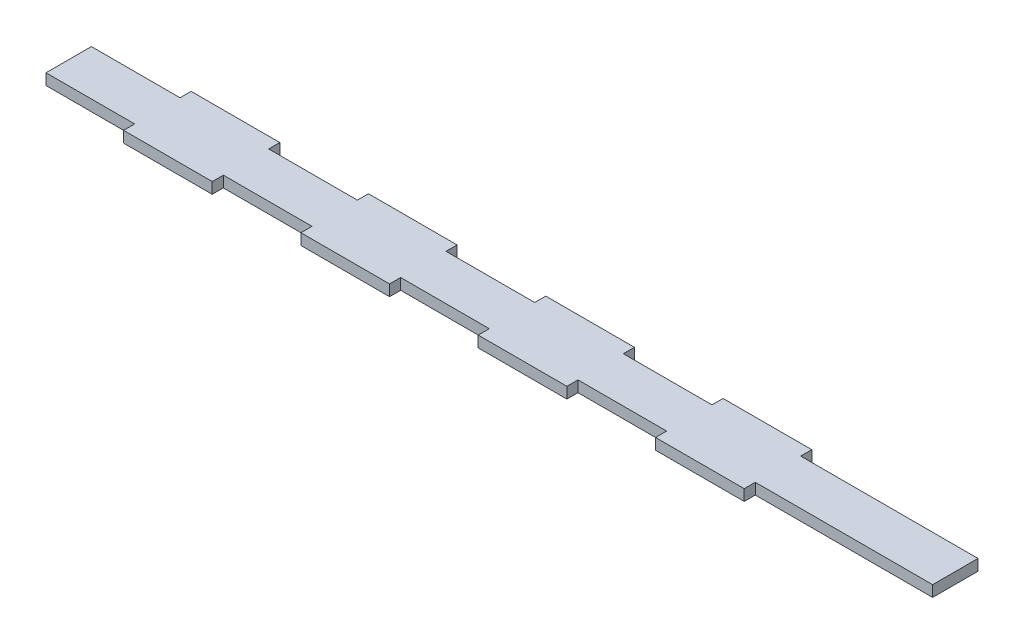
ISO-10303-21;
HEADER;
FILE_DESCRIPTION(('STEP AP214'),'2;1');
FILE_NAME('part.step','',(''),(''),'','','');
FILE_SCHEMA(('AUTOMOTIVE_DESIGN { 1 0 10303 214 1 1 1 1 }'));
ENDSEC;
DATA;
#1=APPLICATION_CONTEXT('core data for automotive mechanical design processes');
#2=APPLICATION_PROTOCOL_DEFINITION('international standard','automotive_design',2000,#1);
#3=PRODUCT_CONTEXT('',#1,'mechanical');
#4=PRODUCT('Part','Part','',(#3));
#5=PRODUCT_RELATED_PRODUCT_CATEGORY('part','',(#4));
#6=PRODUCT_DEFINITION_FORMATION('','',#4);
#7=PRODUCT_DEFINITION_CONTEXT('part definition',#1,'design');
#8=PRODUCT_DEFINITION('design','',#6,#7);
#9=PRODUCT_DEFINITION_SHAPE('','',#8);
#10=(LENGTH_UNIT() NAMED_UNIT(*) SI_UNIT(.MILLI.,.METRE.));
#11=(NAMED_UNIT(*) PLANE_ANGLE_UNIT() SI_UNIT($,.RADIAN.));
#12=(NAMED_UNIT(*) SI_UNIT($,.STERADIAN.) SOLID_ANGLE_UNIT());
#13=UNCERTAINTY_MEASURE_WITH_UNIT(LENGTH_MEASURE(1.E-05),#10,'distance_accuracy_value','');
#14=(GEOMETRIC_REPRESENTATION_CONTEXT(3) GLOBAL_UNCERTAINTY_ASSIGNED_CONTEXT((#13)) GLOBAL_UNIT_ASSIGNED_CONTEXT((#10,
#11,#12)) REPRESENTATION_CONTEXT('',''));
#15=CARTESIAN_POINT('',(0.,0.,0.));
#16=DIRECTION('',(0.,0.,1.));
#17=DIRECTION('',(1.,0.,0.));
#18=AXIS2_PLACEMENT_3D('',#15,#16,#17);
#19=CARTESIAN_POINT('',(0.,1.5875,6.5));
#20=DIRECTION('',(0.,0.,-1.));
#21=DIRECTION('',(-1.,0.,0.));
#22=AXIS2_PLACEMENT_3D('',#19,#20,#21);
#23=PLANE('',#22);
#24=DIRECTION('',(0.,-1.,0.));
#25=VECTOR('',#24,1.);
#26=CARTESIAN_POINT('',(-88.9,1.5875,6.5));
#27=LINE('',#26,#25);
#28=CARTESIAN_POINT('',(-88.9,1.5875,6.5));
#29=VERTEX_POINT('',#28);
#30=CARTESIAN_POINT('',(-88.9,-1.5875,6.5));
#31=VERTEX_POINT('',#30);
#32=EDGE_CURVE('E12',#29,#31,#27,.T.);
#33=ORIENTED_EDGE('',*,*,#32,.F.);
#34=DIRECTION('',(1.,0.,0.));
#35=VECTOR('',#34,1.);
#36=CARTESIAN_POINT('',(0.,1.5875,6.5));
#37=LINE('',#36,#35);
#38=CARTESIAN_POINT('',(-114.3,1.5875,6.5));
#39=VERTEX_POINT('',#38);
#40=EDGE_CURVE('E814',#39,#29,#37,.T.);
#41=ORIENTED_EDGE('',*,*,#40,.F.);
#42=DIRECTION('',(0.,-1.,0.));
#43=VECTOR('',#42,1.);
#44=CARTESIAN_POINT('',(-114.3,1.5875,6.5));
#45=LINE('',#44,#43);
#46=CARTESIAN_POINT('',(-114.3,-1.5875,6.5));
#47=VERTEX_POINT('',#46);
#48=EDGE_CURVE('E443',#39,#47,#45,.T.);
#49=ORIENTED_EDGE('',*,*,#48,.T.);
#50=DIRECTION('',(1.,0.,0.));
#51=VECTOR('',#50,1.);
#52=CARTESIAN_POINT('',(0.,-1.5875,6.5));
#53=LINE('',#52,#51);
#54=EDGE_CURVE('E579',#47,#31,#53,.T.);
#55=ORIENTED_EDGE('',*,*,#54,.T.);
#56=EDGE_LOOP('',(#33,#41,#49,#55));
#57=FACE_BOUND('',#56,.T.);
#58=ADVANCED_FACE('F329',(#57),#23,.F.);
#59=CARTESIAN_POINT('',(-63.5,1.5875,6.5));
#60=VERTEX_POINT('',#59);
#61=CARTESIAN_POINT('',(-38.1,1.5875,6.5));
#62=VERTEX_POINT('',#61);
#63=EDGE_CURVE('E825',#60,#62,#37,.T.);
#64=ORIENTED_EDGE('',*,*,#63,.F.);
#65=DIRECTION('',(0.,-1.,0.));
#66=VECTOR('',#65,1.);
#67=CARTESIAN_POINT('',(-63.5,1.5875,6.5));
#68=LINE('',#67,#66);
#69=CARTESIAN_POINT('',(-63.5,-1.5875,6.5));
#70=VERTEX_POINT('',#69);
#71=EDGE_CURVE('E339',#60,#70,#68,.T.);
#72=ORIENTED_EDGE('',*,*,#71,.T.);
#73=CARTESIAN_POINT('',(-38.1,-1.5875,6.5));
#74=VERTEX_POINT('',#73);
#75=EDGE_CURVE('E578',#70,#74,#53,.T.);
#76=ORIENTED_EDGE('',*,*,#75,.T.);
#77=DIRECTION('',(0.,-1.,0.));
#78=VECTOR('',#77,1.);
#79=CARTESIAN_POINT('',(-38.1,1.5875,6.5));
#80=LINE('',#79,#78);
#81=EDGE_CURVE('E446',#62,#74,#80,.T.);
#82=ORIENTED_EDGE('',*,*,#81,.F.);
#83=EDGE_LOOP('',(#64,#72,#76,#82));
#84=FACE_BOUND('',#83,.T.);
#85=ADVANCED_FACE('F900',(#84),#23,.F.);
#86=CARTESIAN_POINT('',(-38.1,1.5875,0.));
#87=DIRECTION('',(1.,0.,0.));
#88=DIRECTION('',(0.,0.,-1.));
#89=AXIS2_PLACEMENT_3D('',#86,#87,#88);
#90=PLANE('',#89);
#91=DIRECTION('',(0.,0.,1.));
#92=VECTOR('',#91,1.);
#93=CARTESIAN_POINT('',(-38.1,-1.5875,0.));
#94=LINE('',#93,#92);
#95=CARTESIAN_POINT('',(-38.1,-1.5875,9.675));
#96=VERTEX_POINT('',#95);
#97=EDGE_CURVE('E582',#74,#96,#94,.T.);
#98=ORIENTED_EDGE('',*,*,#97,.T.);
#99=DIRECTION('',(0.,-1.,0.));
#100=VECTOR('',#99,1.);
#101=CARTESIAN_POINT('',(-38.1,1.5875,9.675));
#102=LINE('',#101,#100);
#103=CARTESIAN_POINT('',(-38.1,1.5875,9.675));
#104=VERTEX_POINT('',#103);
#105=EDGE_CURVE('E674',#104,#96,#102,.T.);
#106=ORIENTED_EDGE('',*,*,#105,.F.);
#107=DIRECTION('',(0.,0.,1.));
#108=VECTOR('',#107,1.);
#109=CARTESIAN_POINT('',(-38.1,1.5875,0.));
#110=LINE('',#109,#108);
#111=EDGE_CURVE('E687',#62,#104,#110,.T.);
#112=ORIENTED_EDGE('',*,*,#111,.F.);
#113=ORIENTED_EDGE('',*,*,#81,.T.);
#114=EDGE_LOOP('',(#98,#106,#112,#113));
#115=FACE_BOUND('',#114,.T.);
#116=ADVANCED_FACE('F682',(#115),#90,.F.);
#117=CARTESIAN_POINT('',(0.,1.5875,9.675));
#118=DIRECTION('',(0.,0.,-1.));
#119=DIRECTION('',(-1.,0.,0.));
#120=AXIS2_PLACEMENT_3D('',#117,#118,#119);
#121=PLANE('',#120);
#122=DIRECTION('',(1.,0.,0.));
#123=VECTOR('',#122,1.);
#124=CARTESIAN_POINT('',(0.,-1.5875,9.675));
#125=LINE('',#124,#123);
#126=CARTESIAN_POINT('',(-12.7,-1.5875,9.675));
#127=VERTEX_POINT('',#126);
#128=EDGE_CURVE('E586',#96,#127,#125,.T.);
#129=ORIENTED_EDGE('',*,*,#128,.T.);
#130=DIRECTION('',(0.,-1.,0.));
#131=VECTOR('',#130,1.);
#132=CARTESIAN_POINT('',(-12.7,1.5875,9.675));
#133=LINE('',#132,#131);
#134=CARTESIAN_POINT('',(-12.7,1.5875,9.675));
#135=VERTEX_POINT('',#134);
#136=EDGE_CURVE('E671',#135,#127,#133,.T.);
#137=ORIENTED_EDGE('',*,*,#136,.F.);
#138=DIRECTION('',(1.,0.,0.));
#139=VECTOR('',#138,1.);
#140=CARTESIAN_POINT('',(0.,1.5875,9.675));
#141=LINE('',#140,#139);
#142=EDGE_CURVE('E832',#104,#135,#141,.T.);
#143=ORIENTED_EDGE('',*,*,#142,.F.);
#144=ORIENTED_EDGE('',*,*,#105,.T.);
#145=EDGE_LOOP('',(#129,#137,#143,#144));
#146=FACE_BOUND('',#145,.T.);
#147=ADVANCED_FACE('F701',(#146),#121,.F.);
#148=CARTESIAN_POINT('',(-12.7,1.5875,0.));
#149=DIRECTION('',(1.,0.,0.));
#150=DIRECTION('',(0.,0.,-1.));
#151=AXIS2_PLACEMENT_3D('',#148,#149,#150);
#152=PLANE('',#151);
#153=DIRECTION('',(0.,0.,1.));
#154=VECTOR('',#153,1.);
#155=CARTESIAN_POINT('',(-12.7,-1.5875,0.));
#156=LINE('',#155,#154);
#157=CARTESIAN_POINT('',(-12.7,-1.5875,6.5));
#158=VERTEX_POINT('',#157);
#159=EDGE_CURVE('E589',#158,#127,#156,.T.);
#160=ORIENTED_EDGE('',*,*,#159,.F.);
#161=DIRECTION('',(0.,-1.,0.));
#162=VECTOR('',#161,1.);
#163=CARTESIAN_POINT('',(-12.7,1.5875,6.5));
#164=LINE('',#163,#162);
#165=CARTESIAN_POINT('',(-12.7,1.5875,6.5));
#166=VERTEX_POINT('',#165);
#167=EDGE_CURVE('E668',#166,#158,#164,.T.);
#168=ORIENTED_EDGE('',*,*,#167,.F.);
#169=DIRECTION('',(0.,0.,1.));
#170=VECTOR('',#169,1.);
#171=CARTESIAN_POINT('',(-12.7,1.5875,0.));
#172=LINE('',#171,#170);
#173=EDGE_CURVE('E835',#166,#135,#172,.T.);
#174=ORIENTED_EDGE('',*,*,#173,.T.);
#175=ORIENTED_EDGE('',*,*,#136,.T.);
#176=EDGE_LOOP('',(#160,#168,#174,#175));
#177=FACE_BOUND('',#176,.T.);
#178=ADVANCED_FACE('F919',(#177),#152,.T.);
#179=CARTESIAN_POINT('',(12.7,-1.5875,6.5));
#180=VERTEX_POINT('',#179);
#181=EDGE_CURVE('E583',#158,#180,#53,.T.);
#182=ORIENTED_EDGE('',*,*,#181,.T.);
#183=DIRECTION('',(0.,-1.,0.));
#184=VECTOR('',#183,1.);
#185=CARTESIAN_POINT('',(12.7,1.5875,6.5));
#186=LINE('',#185,#184);
#187=CARTESIAN_POINT('',(12.7,1.5875,6.5));
#188=VERTEX_POINT('',#187);
#189=EDGE_CURVE('E665',#188,#180,#186,.T.);
#190=ORIENTED_EDGE('',*,*,#189,.F.);
#191=EDGE_CURVE('E830',#166,#188,#37,.T.);
#192=ORIENTED_EDGE('',*,*,#191,.F.);
#193=ORIENTED_EDGE('',*,*,#167,.T.);
#194=EDGE_LOOP('',(#182,#190,#192,#193));
#195=FACE_BOUND('',#194,.T.);
#196=ADVANCED_FACE('F872',(#195),#23,.F.);
#197=CARTESIAN_POINT('',(12.7,1.5875,0.));
#198=DIRECTION('',(1.,0.,0.));
#199=DIRECTION('',(0.,0.,-1.));
#200=AXIS2_PLACEMENT_3D('',#197,#198,#199);
#201=PLANE('',#200);
#202=DIRECTION('',(0.,0.,1.));
#203=VECTOR('',#202,1.);
#204=CARTESIAN_POINT('',(12.7,-1.5875,0.));
#205=LINE('',#204,#203);
#206=CARTESIAN_POINT('',(12.7,-1.5875,9.675));
#207=VERTEX_POINT('',#206);
#208=EDGE_CURVE('E592',#180,#207,#205,.T.);
#209=ORIENTED_EDGE('',*,*,#208,.T.);
#210=DIRECTION('',(0.,-1.,0.));
#211=VECTOR('',#210,1.);
#212=CARTESIAN_POINT('',(12.7,1.5875,9.675));
#213=LINE('',#212,#211);
#214=CARTESIAN_POINT('',(12.7,1.5875,9.675));
#215=VERTEX_POINT('',#214);
#216=EDGE_CURVE('E662',#215,#207,#213,.T.);
#217=ORIENTED_EDGE('',*,*,#216,.F.);
#218=DIRECTION('',(0.,0.,1.));
#219=VECTOR('',#218,1.);
#220=CARTESIAN_POINT('',(12.7,1.5875,0.));
#221=LINE('',#220,#219);
#222=EDGE_CURVE('E837',#188,#215,#221,.T.);
#223=ORIENTED_EDGE('',*,*,#222,.F.);
#224=ORIENTED_EDGE('',*,*,#189,.T.);
#225=EDGE_LOOP('',(#209,#217,#223,#224));
#226=FACE_BOUND('',#225,.T.);
#227=ADVANCED_FACE('F875',(#226),#201,.F.);
#228=CARTESIAN_POINT('',(0.,1.5875,9.675));
#229=DIRECTION('',(0.,0.,-1.));
#230=DIRECTION('',(-1.,0.,0.));
#231=AXIS2_PLACEMENT_3D('',#228,#229,#230);
#232=PLANE('',#231);
#233=DIRECTION('',(1.,0.,0.));
#234=VECTOR('',#233,1.);
#235=CARTESIAN_POINT('',(0.,-1.5875,9.675));
#236=LINE('',#235,#234);
#237=CARTESIAN_POINT('',(38.1000000000001,-1.5875,9.675));
#238=VERTEX_POINT('',#237);
#239=EDGE_CURVE('E595',#207,#238,#236,.T.);
#240=ORIENTED_EDGE('',*,*,#239,.T.);
#241=DIRECTION('',(0.,-1.,0.));
#242=VECTOR('',#241,1.);
#243=CARTESIAN_POINT('',(38.1000000000001,1.5875,9.675));
#244=LINE('',#243,#242);
#245=CARTESIAN_POINT('',(38.1000000000001,1.5875,9.675));
#246=VERTEX_POINT('',#245);
#247=EDGE_CURVE('E659',#246,#238,#244,.T.);
#248=ORIENTED_EDGE('',*,*,#247,.F.);
#249=DIRECTION('',(1.,0.,0.));
#250=VECTOR('',#249,1.);
#251=CARTESIAN_POINT('',(0.,1.5875,9.675));
#252=LINE('',#251,#250);
#253=EDGE_CURVE('E840',#215,#246,#252,.T.);
#254=ORIENTED_EDGE('',*,*,#253,.F.);
#255=ORIENTED_EDGE('',*,*,#216,.T.);
#256=EDGE_LOOP('',(#240,#248,#254,#255));
#257=FACE_BOUND('',#256,.T.);
#258=ADVANCED_FACE('F882',(#257),#232,.F.);
#259=CARTESIAN_POINT('',(38.1000000000001,1.5875,0.));
#260=DIRECTION('',(1.,0.,0.));
#261=DIRECTION('',(0.,0.,-1.));
#262=AXIS2_PLACEMENT_3D('',#259,#260,#261);
#263=PLANE('',#262);
#264=DIRECTION('',(0.,0.,1.));
#265=VECTOR('',#264,1.);
#266=CARTESIAN_POINT('',(38.1000000000001,-1.5875,0.));
#267=LINE('',#266,#265);
#268=CARTESIAN_POINT('',(38.1000000000001,-1.5875,6.5));
#269=VERTEX_POINT('',#268);
#270=EDGE_CURVE('E598',#269,#238,#267,.T.);
#271=ORIENTED_EDGE('',*,*,#270,.F.);
#272=DIRECTION('',(0.,-1.,0.));
#273=VECTOR('',#272,1.);
#274=CARTESIAN_POINT('',(38.1000000000001,1.5875,6.5));
#275=LINE('',#274,#273);
#276=CARTESIAN_POINT('',(38.1000000000001,1.5875,6.5));
#277=VERTEX_POINT('',#276);
#278=EDGE_CURVE('E656',#277,#269,#275,.T.);
#279=ORIENTED_EDGE('',*,*,#278,.F.);
#280=DIRECTION('',(0.,0.,1.));
#281=VECTOR('',#280,1.);
#282=CARTESIAN_POINT('',(38.1000000000001,1.5875,0.));
#283=LINE('',#282,#281);
#284=EDGE_CURVE('E843',#277,#246,#283,.T.);
#285=ORIENTED_EDGE('',*,*,#284,.T.);
#286=ORIENTED_EDGE('',*,*,#247,.T.);
#287=EDGE_LOOP('',(#271,#279,#285,#286));
#288=FACE_BOUND('',#287,.T.);
#289=ADVANCED_FACE('F923',(#288),#263,.T.);
#290=CARTESIAN_POINT('',(63.5000000000001,-1.5875,6.5));
#291=VERTEX_POINT('',#290);
#292=EDGE_CURVE('E601',#269,#291,#53,.T.);
#293=ORIENTED_EDGE('',*,*,#292,.T.);
#294=DIRECTION('',(0.,-1.,0.));
#295=VECTOR('',#294,1.);
#296=CARTESIAN_POINT('',(63.5000000000001,1.5875,6.5));
#297=LINE('',#296,#295);
#298=CARTESIAN_POINT('',(63.5000000000001,1.5875,6.5));
#299=VERTEX_POINT('',#298);
#300=EDGE_CURVE('E653',#299,#291,#297,.T.);
#301=ORIENTED_EDGE('',*,*,#300,.F.);
#302=EDGE_CURVE('E846',#277,#299,#37,.T.);
#303=ORIENTED_EDGE('',*,*,#302,.F.);
#304=ORIENTED_EDGE('',*,*,#278,.T.);
#305=EDGE_LOOP('',(#293,#301,#303,#304));
#306=FACE_BOUND('',#305,.T.);
#307=ADVANCED_FACE('F925',(#306),#23,.F.);
#308=CARTESIAN_POINT('',(63.5000000000001,1.5875,0.));
#309=DIRECTION('',(1.,0.,0.));
#310=DIRECTION('',(0.,0.,-1.));
#311=AXIS2_PLACEMENT_3D('',#308,#309,#310);
#312=PLANE('',#311);
#313=DIRECTION('',(0.,0.,1.));
#314=VECTOR('',#313,1.);
#315=CARTESIAN_POINT('',(63.5000000000001,-1.5875,0.));
#316=LINE('',#315,#314);
#317=CARTESIAN_POINT('',(63.5000000000001,-1.5875,9.675));
#318=VERTEX_POINT('',#317);
#319=EDGE_CURVE('E602',#291,#318,#316,.T.);
#320=ORIENTED_EDGE('',*,*,#319,.T.);
#321=DIRECTION('',(0.,-1.,0.));
#322=VECTOR('',#321,1.);
#323=CARTESIAN_POINT('',(63.5000000000001,1.5875,9.675));
#324=LINE('',#323,#322);
#325=CARTESIAN_POINT('',(63.5000000000001,1.5875,9.675));
#326=VERTEX_POINT('',#325);
#327=EDGE_CURVE('E650',#326,#318,#324,.T.);
#328=ORIENTED_EDGE('',*,*,#327,.F.);
#329=DIRECTION('',(0.,0.,1.));
#330=VECTOR('',#329,1.);
#331=CARTESIAN_POINT('',(63.5000000000001,1.5875,0.));
#332=LINE('',#331,#330);
#333=EDGE_CURVE('E847',#299,#326,#332,.T.);
#334=ORIENTED_EDGE('',*,*,#333,.F.);
#335=ORIENTED_EDGE('',*,*,#300,.T.);
#336=EDGE_LOOP('',(#320,#328,#334,#335));
#337=FACE_BOUND('',#336,.T.);
#338=ADVANCED_FACE('F927',(#337),#312,.F.);
#339=CARTESIAN_POINT('',(0.,1.5875,9.675));
#340=DIRECTION('',(0.,0.,-1.));
#341=DIRECTION('',(-1.,0.,0.));
#342=AXIS2_PLACEMENT_3D('',#339,#340,#341);
#343=PLANE('',#342);
#344=DIRECTION('',(1.,0.,0.));
#345=VECTOR('',#344,1.);
#346=CARTESIAN_POINT('',(0.,-1.5875,9.675));
#347=LINE('',#346,#345);
#348=CARTESIAN_POINT('',(88.9000000000001,-1.5875,9.675));
#349=VERTEX_POINT('',#348);
#350=EDGE_CURVE('E605',#318,#349,#347,.T.);
#351=ORIENTED_EDGE('',*,*,#350,.T.);
#352=DIRECTION('',(0.,-1.,0.));
#353=VECTOR('',#352,1.);
#354=CARTESIAN_POINT('',(88.9000000000001,1.5875,9.675));
#355=LINE('',#354,#353);
#356=CARTESIAN_POINT('',(88.9000000000001,1.5875,9.675));
#357=VERTEX_POINT('',#356);
#358=EDGE_CURVE('E647',#357,#349,#355,.T.);
#359=ORIENTED_EDGE('',*,*,#358,.F.);
#360=DIRECTION('',(1.,0.,0.));
#361=VECTOR('',#360,1.);
#362=CARTESIAN_POINT('',(0.,1.5875,9.675));
#363=LINE('',#362,#361);
#364=EDGE_CURVE('E850',#326,#357,#363,.T.);
#365=ORIENTED_EDGE('',*,*,#364,.F.);
#366=ORIENTED_EDGE('',*,*,#327,.T.);
#367=EDGE_LOOP('',(#351,#359,#365,#366));
#368=FACE_BOUND('',#367,.T.);
#369=ADVANCED_FACE('F895',(#368),#343,.F.);
#370=CARTESIAN_POINT('',(88.9000000000001,1.5875,0.));
#371=DIRECTION('',(1.,0.,0.));
#372=DIRECTION('',(0.,0.,-1.));
#373=AXIS2_PLACEMENT_3D('',#370,#371,#372);
#374=PLANE('',#373);
#375=DIRECTION('',(0.,0.,1.));
#376=VECTOR('',#375,1.);
#377=CARTESIAN_POINT('',(88.9000000000001,-1.5875,0.));
#378=LINE('',#377,#376);
#379=CARTESIAN_POINT('',(88.9000000000001,-1.5875,6.5));
#380=VERTEX_POINT('',#379);
#381=EDGE_CURVE('E608',#380,#349,#378,.T.);
#382=ORIENTED_EDGE('',*,*,#381,.F.);
#383=DIRECTION('',(0.,-1.,0.));
#384=VECTOR('',#383,1.);
#385=CARTESIAN_POINT('',(88.9000000000001,1.5875,6.5));
#386=LINE('',#385,#384);
#387=CARTESIAN_POINT('',(88.9000000000001,1.5875,6.5));
#388=VERTEX_POINT('',#387);
#389=EDGE_CURVE('E644',#388,#380,#386,.T.);
#390=ORIENTED_EDGE('',*,*,#389,.F.);
#391=DIRECTION('',(0.,0.,1.));
#392=VECTOR('',#391,1.);
#393=CARTESIAN_POINT('',(88.9000000000001,1.5875,0.));
#394=LINE('',#393,#392);
#395=EDGE_CURVE('E853',#388,#357,#394,.T.);
#396=ORIENTED_EDGE('',*,*,#395,.T.);
#397=ORIENTED_EDGE('',*,*,#358,.T.);
#398=EDGE_LOOP('',(#382,#390,#396,#397));
#399=FACE_BOUND('',#398,.T.);
#400=ADVANCED_FACE('F898',(#399),#374,.T.);
#401=CARTESIAN_POINT('',(139.7,-1.5875,6.5));
#402=VERTEX_POINT('',#401);
#403=EDGE_CURVE('E611',#380,#402,#53,.T.);
#404=ORIENTED_EDGE('',*,*,#403,.T.);
#405=DIRECTION('',(0.,-1.,0.));
#406=VECTOR('',#405,1.);
#407=CARTESIAN_POINT('',(139.7,1.5875,6.5));
#408=LINE('',#407,#406);
#409=CARTESIAN_POINT('',(139.7,1.5875,6.5));
#410=VERTEX_POINT('',#409);
#411=EDGE_CURVE('E641',#410,#402,#408,.T.);
#412=ORIENTED_EDGE('',*,*,#411,.F.);
#413=EDGE_CURVE('E543',#388,#410,#37,.T.);
#414=ORIENTED_EDGE('',*,*,#413,.F.);
#415=ORIENTED_EDGE('',*,*,#389,.T.);
#416=EDGE_LOOP('',(#404,#412,#414,#415));
#417=FACE_BOUND('',#416,.T.);
#418=ADVANCED_FACE('F791',(#417),#23,.F.);
#419=CARTESIAN_POINT('',(139.7,1.5875,0.));
#420=DIRECTION('',(-1.,0.,0.));
#421=DIRECTION('',(0.,0.,1.));
#422=AXIS2_PLACEMENT_3D('',#419,#420,#421);
#423=PLANE('',#422);
#424=DIRECTION('',(0.,0.,-1.));
#425=VECTOR('',#424,1.);
#426=CARTESIAN_POINT('',(139.7,-1.5875,0.));
#427=LINE('',#426,#425);
#428=CARTESIAN_POINT('',(139.7,-1.5875,-6.49999999999998));
#429=VERTEX_POINT('',#428);
#430=EDGE_CURVE('E612',#402,#429,#427,.T.);
#431=ORIENTED_EDGE('',*,*,#430,.T.);
#432=DIRECTION('',(0.,-1.,0.));
#433=VECTOR('',#432,1.);
#434=CARTESIAN_POINT('',(139.7,1.5875,-6.49999999999998));
#435=LINE('',#434,#433);
#436=CARTESIAN_POINT('',(139.7,1.5875,-6.49999999999998));
#437=VERTEX_POINT('',#436);
#438=EDGE_CURVE('E639',#437,#429,#435,.T.);
#439=ORIENTED_EDGE('',*,*,#438,.F.);
#440=DIRECTION('',(0.,0.,-1.));
#441=VECTOR('',#440,1.);
#442=CARTESIAN_POINT('',(139.7,1.5875,0.));
#443=LINE('',#442,#441);
#444=EDGE_CURVE('E536',#410,#437,#443,.T.);
#445=ORIENTED_EDGE('',*,*,#444,.F.);
#446=ORIENTED_EDGE('',*,*,#411,.T.);
#447=EDGE_LOOP('',(#431,#439,#445,#446));
#448=FACE_BOUND('',#447,.T.);
#449=ADVANCED_FACE('F786',(#448),#423,.F.);
#450=CARTESIAN_POINT('',(0.,1.5875,-6.49999999999999));
#451=DIRECTION('',(0.,0.,-1.));
#452=DIRECTION('',(-1.,0.,0.));
#453=AXIS2_PLACEMENT_3D('',#450,#451,#452);
#454=PLANE('',#453);
#455=DIRECTION('',(1.,0.,0.));
#456=VECTOR('',#455,1.);
#457=CARTESIAN_POINT('',(0.,-1.5875,-6.49999999999999));
#458=LINE('',#457,#456);
#459=CARTESIAN_POINT('',(88.9000000000001,-1.5875,-6.49999999999999));
#460=VERTEX_POINT('',#459);
#461=EDGE_CURVE('E615',#460,#429,#458,.T.);
#462=ORIENTED_EDGE('',*,*,#461,.F.);
#463=DIRECTION('',(0.,1.,0.));
#464=VECTOR('',#463,1.);
#465=CARTESIAN_POINT('',(88.9000000000001,1.5875,-6.49999999999999));
#466=LINE('',#465,#464);
#467=CARTESIAN_POINT('',(88.9000000000001,1.5875,-6.49999999999999));
#468=VERTEX_POINT('',#467);
#469=EDGE_CURVE('E348',#460,#468,#466,.T.);
#470=ORIENTED_EDGE('',*,*,#469,.T.);
#471=DIRECTION('',(1.,0.,0.));
#472=VECTOR('',#471,1.);
#473=CARTESIAN_POINT('',(0.,1.5875,-6.49999999999999));
#474=LINE('',#473,#472);
#475=EDGE_CURVE('E532',#468,#437,#474,.T.);
#476=ORIENTED_EDGE('',*,*,#475,.T.);
#477=ORIENTED_EDGE('',*,*,#438,.T.);
#478=EDGE_LOOP('',(#462,#470,#476,#477));
#479=FACE_BOUND('',#478,.T.);
#480=ADVANCED_FACE('F784',(#479),#454,.T.);
#481=CARTESIAN_POINT('',(38.1000000000001,-1.5875,-6.49999999999999));
#482=VERTEX_POINT('',#481);
#483=CARTESIAN_POINT('',(63.5000000000001,-1.5875,-6.49999999999999));
#484=VERTEX_POINT('',#483);
#485=EDGE_CURVE('E775',#482,#484,#458,.T.);
#486=ORIENTED_EDGE('',*,*,#485,.F.);
#487=DIRECTION('',(0.,1.,0.));
#488=VECTOR('',#487,1.);
#489=CARTESIAN_POINT('',(38.1000000000001,1.5875,-6.49999999999999));
#490=LINE('',#489,#488);
#491=CARTESIAN_POINT('',(38.1000000000001,1.5875,-6.49999999999999));
#492=VERTEX_POINT('',#491);
#493=EDGE_CURVE('E435',#482,#492,#490,.T.);
#494=ORIENTED_EDGE('',*,*,#493,.T.);
#495=CARTESIAN_POINT('',(63.5000000000001,1.5875,-6.49999999999999));
#496=VERTEX_POINT('',#495);
#497=EDGE_CURVE('E539',#492,#496,#474,.T.);
#498=ORIENTED_EDGE('',*,*,#497,.T.);
#499=DIRECTION('',(0.,-1.,0.));
#500=VECTOR('',#499,1.);
#501=CARTESIAN_POINT('',(63.5000000000001,1.5875,-6.5));
#502=LINE('',#501,#500);
#503=EDGE_CURVE('E433',#496,#484,#502,.T.);
#504=ORIENTED_EDGE('',*,*,#503,.T.);
#505=EDGE_LOOP('',(#486,#494,#498,#504));
#506=FACE_BOUND('',#505,.T.);
#507=ADVANCED_FACE('F773',(#506),#454,.T.);
#508=CARTESIAN_POINT('',(-12.7,-1.5875,-6.49999999999999));
#509=VERTEX_POINT('',#508);
#510=CARTESIAN_POINT('',(12.7,-1.5875,-6.49999999999999));
#511=VERTEX_POINT('',#510);
#512=EDGE_CURVE('E620',#509,#511,#458,.T.);
#513=ORIENTED_EDGE('',*,*,#512,.F.);
#514=DIRECTION('',(0.,1.,0.));
#515=VECTOR('',#514,1.);
#516=CARTESIAN_POINT('',(-12.7,1.5875,-6.49999999999999));
#517=LINE('',#516,#515);
#518=CARTESIAN_POINT('',(-12.7,1.5875,-6.49999999999999));
#519=VERTEX_POINT('',#518);
#520=EDGE_CURVE('E450',#509,#519,#517,.T.);
#521=ORIENTED_EDGE('',*,*,#520,.T.);
#522=CARTESIAN_POINT('',(12.7,1.5875,-6.49999999999999));
#523=VERTEX_POINT('',#522);
#524=EDGE_CURVE('E542',#519,#523,#474,.T.);
#525=ORIENTED_EDGE('',*,*,#524,.T.);
#526=DIRECTION('',(0.,-1.,0.));
#527=VECTOR('',#526,1.);
#528=CARTESIAN_POINT('',(12.7,1.5875,-6.5));
#529=LINE('',#528,#527);
#530=EDGE_CURVE('E441',#523,#511,#529,.T.);
#531=ORIENTED_EDGE('',*,*,#530,.T.);
#532=EDGE_LOOP('',(#513,#521,#525,#531));
#533=FACE_BOUND('',#532,.T.);
#534=ADVANCED_FACE('F1143',(#533),#454,.T.);
#535=CARTESIAN_POINT('',(-63.5,1.5875,-6.5));
#536=VERTEX_POINT('',#535);
#537=CARTESIAN_POINT('',(-38.1,1.5875,-6.49999999999999));
#538=VERTEX_POINT('',#537);
#539=EDGE_CURVE('E541',#536,#538,#474,.T.);
#540=ORIENTED_EDGE('',*,*,#539,.T.);
#541=DIRECTION('',(0.,-1.,0.));
#542=VECTOR('',#541,1.);
#543=CARTESIAN_POINT('',(-38.1,1.5875,-6.5));
#544=LINE('',#543,#542);
#545=CARTESIAN_POINT('',(-38.1,-1.5875,-6.49999999999999));
#546=VERTEX_POINT('',#545);
#547=EDGE_CURVE('E453',#538,#546,#544,.T.);
#548=ORIENTED_EDGE('',*,*,#547,.T.);
#549=CARTESIAN_POINT('',(-63.5,-1.5875,-6.5));
#550=VERTEX_POINT('',#549);
#551=EDGE_CURVE('E616',#550,#546,#458,.T.);
#552=ORIENTED_EDGE('',*,*,#551,.F.);
#553=DIRECTION('',(0.,-1.,0.));
#554=VECTOR('',#553,1.);
#555=CARTESIAN_POINT('',(-63.5,1.5875,-6.5));
#556=LINE('',#555,#554);
#557=EDGE_CURVE('E636',#536,#550,#556,.T.);
#558=ORIENTED_EDGE('',*,*,#557,.F.);
#559=EDGE_LOOP('',(#540,#548,#552,#558));
#560=FACE_BOUND('',#559,.T.);
#561=ADVANCED_FACE('F1130',(#560),#454,.T.);
#562=CARTESIAN_POINT('',(-63.5,1.5875,0.));
#563=DIRECTION('',(-1.,0.,0.));
#564=DIRECTION('',(0.,0.,1.));
#565=AXIS2_PLACEMENT_3D('',#562,#563,#564);
#566=PLANE('',#565);
#567=DIRECTION('',(0.,0.,-1.));
#568=VECTOR('',#567,1.);
#569=CARTESIAN_POINT('',(-63.5,-1.5875,0.));
#570=LINE('',#569,#568);
#571=CARTESIAN_POINT('',(-63.5,-1.5875,-9.675));
#572=VERTEX_POINT('',#571);
#573=EDGE_CURVE('E619',#550,#572,#570,.T.);
#574=ORIENTED_EDGE('',*,*,#573,.T.);
#575=DIRECTION('',(0.,-1.,0.));
#576=VECTOR('',#575,1.);
#577=CARTESIAN_POINT('',(-63.5,1.5875,-9.675));
#578=LINE('',#577,#576);
#579=CARTESIAN_POINT('',(-63.5,1.5875,-9.675));
#580=VERTEX_POINT('',#579);
#581=EDGE_CURVE('E633',#580,#572,#578,.T.);
#582=ORIENTED_EDGE('',*,*,#581,.F.);
#583=DIRECTION('',(0.,0.,-1.));
#584=VECTOR('',#583,1.);
#585=CARTESIAN_POINT('',(-63.5,1.5875,0.));
#586=LINE('',#585,#584);
#587=EDGE_CURVE('E547',#536,#580,#586,.T.);
#588=ORIENTED_EDGE('',*,*,#587,.F.);
#589=ORIENTED_EDGE('',*,*,#557,.T.);
#590=EDGE_LOOP('',(#574,#582,#588,#589));
#591=FACE_BOUND('',#590,.T.);
#592=ADVANCED_FACE('F1136',(#591),#566,.F.);
#593=CARTESIAN_POINT('',(0.,1.5875,-9.675));
#594=DIRECTION('',(0.,0.,-1.));
#595=DIRECTION('',(-1.,0.,0.));
#596=AXIS2_PLACEMENT_3D('',#593,#594,#595);
#597=PLANE('',#596);
#598=DIRECTION('',(1.,0.,0.));
#599=VECTOR('',#598,1.);
#600=CARTESIAN_POINT('',(0.,-1.5875,-9.675));
#601=LINE('',#600,#599);
#602=CARTESIAN_POINT('',(-88.9,-1.5875,-9.675));
#603=VERTEX_POINT('',#602);
#604=EDGE_CURVE('E624',#603,#572,#601,.T.);
#605=ORIENTED_EDGE('',*,*,#604,.F.);
#606=DIRECTION('',(0.,-1.,0.));
#607=VECTOR('',#606,1.);
#608=CARTESIAN_POINT('',(-88.9,1.5875,-9.675));
#609=LINE('',#608,#607);
#610=CARTESIAN_POINT('',(-88.9,1.5875,-9.675));
#611=VERTEX_POINT('',#610);
#612=EDGE_CURVE('E631',#611,#603,#609,.T.);
#613=ORIENTED_EDGE('',*,*,#612,.F.);
#614=DIRECTION('',(1.,0.,0.));
#615=VECTOR('',#614,1.);
#616=CARTESIAN_POINT('',(0.,1.5875,-9.675));
#617=LINE('',#616,#615);
#618=EDGE_CURVE('E554',#611,#580,#617,.T.);
#619=ORIENTED_EDGE('',*,*,#618,.T.);
#620=ORIENTED_EDGE('',*,*,#581,.T.);
#621=EDGE_LOOP('',(#605,#613,#619,#620));
#622=FACE_BOUND('',#621,.T.);
#623=ADVANCED_FACE('F1133',(#622),#597,.T.);
#624=CARTESIAN_POINT('',(-88.9,1.5875,0.));
#625=DIRECTION('',(-1.,0.,0.));
#626=DIRECTION('',(0.,0.,1.));
#627=AXIS2_PLACEMENT_3D('',#624,#625,#626);
#628=PLANE('',#627);
#629=DIRECTION('',(0.,0.,-1.));
#630=VECTOR('',#629,1.);
#631=CARTESIAN_POINT('',(-88.9,-1.5875,0.));
#632=LINE('',#631,#630);
#633=CARTESIAN_POINT('',(-88.9,-1.5875,-6.5));
#634=VERTEX_POINT('',#633);
#635=EDGE_CURVE('E627',#634,#603,#632,.T.);
#636=ORIENTED_EDGE('',*,*,#635,.F.);
#637=DIRECTION('',(0.,-1.,0.));
#638=VECTOR('',#637,1.);
#639=CARTESIAN_POINT('',(-88.9,1.5875,-6.5));
#640=LINE('',#639,#638);
#641=CARTESIAN_POINT('',(-88.9,1.5875,-6.5));
#642=VERTEX_POINT('',#641);
#643=EDGE_CURVE('E565',#642,#634,#640,.T.);
#644=ORIENTED_EDGE('',*,*,#643,.F.);
#645=DIRECTION('',(0.,0.,-1.));
#646=VECTOR('',#645,1.);
#647=CARTESIAN_POINT('',(-88.9,1.5875,0.));
#648=LINE('',#647,#646);
#649=EDGE_CURVE('E558',#642,#611,#648,.T.);
#650=ORIENTED_EDGE('',*,*,#649,.T.);
#651=ORIENTED_EDGE('',*,*,#612,.T.);
#652=EDGE_LOOP('',(#636,#644,#650,#651));
#653=FACE_BOUND('',#652,.T.);
#654=ADVANCED_FACE('F1129',(#653),#628,.T.);
#655=CARTESIAN_POINT('',(-114.3,-1.5875,-6.5));
#656=VERTEX_POINT('',#655);
#657=EDGE_CURVE('E621',#656,#634,#458,.T.);
#658=ORIENTED_EDGE('',*,*,#657,.F.);
#659=DIRECTION('',(0.,-1.,0.));
#660=VECTOR('',#659,1.);
#661=CARTESIAN_POINT('',(-114.3,1.5875,-6.5));
#662=LINE('',#661,#660);
#663=CARTESIAN_POINT('',(-114.3,1.5875,-6.5));
#664=VERTEX_POINT('',#663);
#665=EDGE_CURVE('E557',#664,#656,#662,.T.);
#666=ORIENTED_EDGE('',*,*,#665,.F.);
#667=EDGE_CURVE('E548',#664,#642,#474,.T.);
#668=ORIENTED_EDGE('',*,*,#667,.T.);
#669=ORIENTED_EDGE('',*,*,#643,.T.);
#670=EDGE_LOOP('',(#658,#666,#668,#669));
#671=FACE_BOUND('',#670,.T.);
#672=ADVANCED_FACE('F823',(#671),#454,.T.);
#673=CARTESIAN_POINT('',(-114.3,1.5875,0.));
#674=DIRECTION('',(-1.,0.,0.));
#675=DIRECTION('',(0.,0.,1.));
#676=AXIS2_PLACEMENT_3D('',#673,#674,#675);
#677=PLANE('',#676);
#678=DIRECTION('',(0.,0.,-1.));
#679=VECTOR('',#678,1.);
#680=CARTESIAN_POINT('',(-114.3,-1.5875,0.));
#681=LINE('',#680,#679);
#682=EDGE_CURVE('E479',#47,#656,#681,.T.);
#683=ORIENTED_EDGE('',*,*,#682,.F.);
#684=ORIENTED_EDGE('',*,*,#48,.F.);
#685=DIRECTION('',(0.,0.,-1.));
#686=VECTOR('',#685,1.);
#687=CARTESIAN_POINT('',(-114.3,1.5875,0.));
#688=LINE('',#687,#686);
#689=EDGE_CURVE('E822',#39,#664,#688,.T.);
#690=ORIENTED_EDGE('',*,*,#689,.T.);
#691=ORIENTED_EDGE('',*,*,#665,.T.);
#692=EDGE_LOOP('',(#683,#684,#690,#691));
#693=FACE_BOUND('',#692,.T.);
#694=ADVANCED_FACE('F821',(#693),#677,.T.);
#695=CARTESIAN_POINT('',(0.,-1.5875,0.));
#696=DIRECTION('',(0.,1.,0.));
#697=DIRECTION('',(0.,0.,1.));
#698=AXIS2_PLACEMENT_3D('',#695,#696,#697);
#699=PLANE('',#698);
#700=ORIENTED_EDGE('',*,*,#682,.T.);
#701=ORIENTED_EDGE('',*,*,#657,.T.);
#702=ORIENTED_EDGE('',*,*,#635,.T.);
#703=ORIENTED_EDGE('',*,*,#604,.T.);
#704=ORIENTED_EDGE('',*,*,#573,.F.);
#705=ORIENTED_EDGE('',*,*,#551,.T.);
#706=DIRECTION('',(0.,0.,-1.));
#707=VECTOR('',#706,1.);
#708=CARTESIAN_POINT('',(-38.1,-1.5875,-6.5));
#709=LINE('',#708,#707);
#710=CARTESIAN_POINT('',(-38.1,-1.5875,-9.675));
#711=VERTEX_POINT('',#710);
#712=EDGE_CURVE('E490',#546,#711,#709,.T.);
#713=ORIENTED_EDGE('',*,*,#712,.T.);
#714=DIRECTION('',(1.,0.,0.));
#715=VECTOR('',#714,1.);
#716=CARTESIAN_POINT('',(-38.1,-1.5875,-9.675));
#717=LINE('',#716,#715);
#718=CARTESIAN_POINT('',(-12.7,-1.5875,-9.675));
#719=VERTEX_POINT('',#718);
#720=EDGE_CURVE('E493',#711,#719,#717,.T.);
#721=ORIENTED_EDGE('',*,*,#720,.T.);
#722=DIRECTION('',(0.,0.,-1.));
#723=VECTOR('',#722,1.);
#724=CARTESIAN_POINT('',(-12.7,-1.5875,-6.5));
#725=LINE('',#724,#723);
#726=EDGE_CURVE('E484',#509,#719,#725,.T.);
#727=ORIENTED_EDGE('',*,*,#726,.F.);
#728=ORIENTED_EDGE('',*,*,#512,.T.);
#729=DIRECTION('',(0.,0.,-1.));
#730=VECTOR('',#729,1.);
#731=CARTESIAN_POINT('',(12.7,-1.5875,-6.5));
#732=LINE('',#731,#730);
#733=CARTESIAN_POINT('',(12.7,-1.5875,-9.675));
#734=VERTEX_POINT('',#733);
#735=EDGE_CURVE('E416',#511,#734,#732,.T.);
#736=ORIENTED_EDGE('',*,*,#735,.T.);
#737=DIRECTION('',(1.,0.,0.));
#738=VECTOR('',#737,1.);
#739=CARTESIAN_POINT('',(12.7,-1.5875,-9.675));
#740=LINE('',#739,#738);
#741=CARTESIAN_POINT('',(38.1000000000001,-1.5875,-9.675));
#742=VERTEX_POINT('',#741);
#743=EDGE_CURVE('E515',#734,#742,#740,.T.);
#744=ORIENTED_EDGE('',*,*,#743,.T.);
#745=DIRECTION('',(0.,0.,-1.));
#746=VECTOR('',#745,1.);
#747=CARTESIAN_POINT('',(38.1000000000001,-1.5875,-6.5));
#748=LINE('',#747,#746);
#749=EDGE_CURVE('E507',#482,#742,#748,.T.);
#750=ORIENTED_EDGE('',*,*,#749,.F.);
#751=ORIENTED_EDGE('',*,*,#485,.T.);
#752=DIRECTION('',(0.,0.,-1.));
#753=VECTOR('',#752,1.);
#754=CARTESIAN_POINT('',(63.5000000000001,-1.5875,-6.5));
#755=LINE('',#754,#753);
#756=CARTESIAN_POINT('',(63.5000000000001,-1.5875,-9.675));
#757=VERTEX_POINT('',#756);
#758=EDGE_CURVE('E428',#484,#757,#755,.T.);
#759=ORIENTED_EDGE('',*,*,#758,.T.);
#760=DIRECTION('',(1.,0.,0.));
#761=VECTOR('',#760,1.);
#762=CARTESIAN_POINT('',(63.5000000000001,-1.5875,-9.675));
#763=LINE('',#762,#761);
#764=CARTESIAN_POINT('',(88.9000000000001,-1.5875,-9.675));
#765=VERTEX_POINT('',#764);
#766=EDGE_CURVE('E411',#757,#765,#763,.T.);
#767=ORIENTED_EDGE('',*,*,#766,.T.);
#768=DIRECTION('',(0.,0.,-1.));
#769=VECTOR('',#768,1.);
#770=CARTESIAN_POINT('',(88.9000000000001,-1.5875,-6.5));
#771=LINE('',#770,#769);
#772=EDGE_CURVE('E418',#460,#765,#771,.T.);
#773=ORIENTED_EDGE('',*,*,#772,.F.);
#774=ORIENTED_EDGE('',*,*,#461,.T.);
#775=ORIENTED_EDGE('',*,*,#430,.F.);
#776=ORIENTED_EDGE('',*,*,#403,.F.);
#777=ORIENTED_EDGE('',*,*,#381,.T.);
#778=ORIENTED_EDGE('',*,*,#350,.F.);
#779=ORIENTED_EDGE('',*,*,#319,.F.);
#780=ORIENTED_EDGE('',*,*,#292,.F.);
#781=ORIENTED_EDGE('',*,*,#270,.T.);
#782=ORIENTED_EDGE('',*,*,#239,.F.);
#783=ORIENTED_EDGE('',*,*,#208,.F.);
#784=ORIENTED_EDGE('',*,*,#181,.F.);
#785=ORIENTED_EDGE('',*,*,#159,.T.);
#786=ORIENTED_EDGE('',*,*,#128,.F.);
#787=ORIENTED_EDGE('',*,*,#97,.F.);
#788=ORIENTED_EDGE('',*,*,#75,.F.);
#789=DIRECTION('',(0.,0.,1.));
#790=VECTOR('',#789,1.);
#791=CARTESIAN_POINT('',(-63.5,-1.5875,6.5));
#792=LINE('',#791,#790);
#793=CARTESIAN_POINT('',(-63.5,-1.5875,9.675));
#794=VERTEX_POINT('',#793);
#795=EDGE_CURVE('E458',#70,#794,#792,.T.);
#796=ORIENTED_EDGE('',*,*,#795,.T.);
#797=DIRECTION('',(1.,0.,0.));
#798=VECTOR('',#797,1.);
#799=CARTESIAN_POINT('',(-88.9,-1.5875,9.675));
#800=LINE('',#799,#798);
#801=CARTESIAN_POINT('',(-88.9,-1.5875,9.675));
#802=VERTEX_POINT('',#801);
#803=EDGE_CURVE('E467',#802,#794,#800,.T.);
#804=ORIENTED_EDGE('',*,*,#803,.F.);
#805=DIRECTION('',(0.,0.,1.));
#806=VECTOR('',#805,1.);
#807=CARTESIAN_POINT('',(-88.9,-1.5875,6.5));
#808=LINE('',#807,#806);
#809=EDGE_CURVE('E464',#31,#802,#808,.T.);
#810=ORIENTED_EDGE('',*,*,#809,.F.);
#811=ORIENTED_EDGE('',*,*,#54,.F.);
#812=EDGE_LOOP('',(#700,#701,#702,#703,#704,#705,#713,#721,#727,#728,#736,#744,#750,#751,#759,
#767,#773,#774,#775,#776,#777,#778,#779,#780,#781,#782,#783,#784,#785,#786,#787,#788,#796,#804,
#810,#811));
#813=FACE_BOUND('',#812,.T.);
#814=ADVANCED_FACE('F426',(#813),#699,.F.);
#815=CARTESIAN_POINT('',(0.,1.5875,0.));
#816=DIRECTION('',(0.,1.,0.));
#817=DIRECTION('',(0.,0.,1.));
#818=AXIS2_PLACEMENT_3D('',#815,#816,#817);
#819=PLANE('',#818);
#820=ORIENTED_EDGE('',*,*,#689,.F.);
#821=ORIENTED_EDGE('',*,*,#40,.T.);
#822=DIRECTION('',(0.,0.,1.));
#823=VECTOR('',#822,1.);
#824=CARTESIAN_POINT('',(-88.9,1.5875,6.5));
#825=LINE('',#824,#823);
#826=CARTESIAN_POINT('',(-88.9,1.5875,9.675));
#827=VERTEX_POINT('',#826);
#828=EDGE_CURVE('E454',#29,#827,#825,.T.);
#829=ORIENTED_EDGE('',*,*,#828,.T.);
#830=DIRECTION('',(1.,0.,0.));
#831=VECTOR('',#830,1.);
#832=CARTESIAN_POINT('',(-88.9,1.5875,9.675));
#833=LINE('',#832,#831);
#834=CARTESIAN_POINT('',(-63.5,1.5875,9.675));
#835=VERTEX_POINT('',#834);
#836=EDGE_CURVE('E457',#827,#835,#833,.T.);
#837=ORIENTED_EDGE('',*,*,#836,.T.);
#838=DIRECTION('',(0.,0.,1.));
#839=VECTOR('',#838,1.);
#840=CARTESIAN_POINT('',(-63.5,1.5875,6.5));
#841=LINE('',#840,#839);
#842=EDGE_CURVE('E460',#60,#835,#841,.T.);
#843=ORIENTED_EDGE('',*,*,#842,.F.);
#844=ORIENTED_EDGE('',*,*,#63,.T.);
#845=ORIENTED_EDGE('',*,*,#111,.T.);
#846=ORIENTED_EDGE('',*,*,#142,.T.);
#847=ORIENTED_EDGE('',*,*,#173,.F.);
#848=ORIENTED_EDGE('',*,*,#191,.T.);
#849=ORIENTED_EDGE('',*,*,#222,.T.);
#850=ORIENTED_EDGE('',*,*,#253,.T.);
#851=ORIENTED_EDGE('',*,*,#284,.F.);
#852=ORIENTED_EDGE('',*,*,#302,.T.);
#853=ORIENTED_EDGE('',*,*,#333,.T.);
#854=ORIENTED_EDGE('',*,*,#364,.T.);
#855=ORIENTED_EDGE('',*,*,#395,.F.);
#856=ORIENTED_EDGE('',*,*,#413,.T.);
#857=ORIENTED_EDGE('',*,*,#444,.T.);
#858=ORIENTED_EDGE('',*,*,#475,.F.);
#859=DIRECTION('',(0.,0.,-1.));
#860=VECTOR('',#859,1.);
#861=CARTESIAN_POINT('',(88.9000000000001,1.5875,-6.5));
#862=LINE('',#861,#860);
#863=CARTESIAN_POINT('',(88.9000000000001,1.5875,-9.675));
#864=VERTEX_POINT('',#863);
#865=EDGE_CURVE('E525',#468,#864,#862,.T.);
#866=ORIENTED_EDGE('',*,*,#865,.T.);
#867=DIRECTION('',(1.,0.,0.));
#868=VECTOR('',#867,1.);
#869=CARTESIAN_POINT('',(63.5000000000001,1.5875,-9.675));
#870=LINE('',#869,#868);
#871=CARTESIAN_POINT('',(63.5000000000001,1.5875,-9.675));
#872=VERTEX_POINT('',#871);
#873=EDGE_CURVE('E414',#872,#864,#870,.T.);
#874=ORIENTED_EDGE('',*,*,#873,.F.);
#875=DIRECTION('',(0.,0.,-1.));
#876=VECTOR('',#875,1.);
#877=CARTESIAN_POINT('',(63.5000000000001,1.5875,-6.5));
#878=LINE('',#877,#876);
#879=EDGE_CURVE('E423',#496,#872,#878,.T.);
#880=ORIENTED_EDGE('',*,*,#879,.F.);
#881=ORIENTED_EDGE('',*,*,#497,.F.);
#882=DIRECTION('',(0.,0.,-1.));
#883=VECTOR('',#882,1.);
#884=CARTESIAN_POINT('',(38.1000000000001,1.5875,-6.5));
#885=LINE('',#884,#883);
#886=CARTESIAN_POINT('',(38.1000000000001,1.5875,-9.675));
#887=VERTEX_POINT('',#886);
#888=EDGE_CURVE('E510',#492,#887,#885,.T.);
#889=ORIENTED_EDGE('',*,*,#888,.T.);
#890=DIRECTION('',(1.,0.,0.));
#891=VECTOR('',#890,1.);
#892=CARTESIAN_POINT('',(12.7,1.5875,-9.675));
#893=LINE('',#892,#891);
#894=CARTESIAN_POINT('',(12.7,1.5875,-9.675));
#895=VERTEX_POINT('',#894);
#896=EDGE_CURVE('E506',#895,#887,#893,.T.);
#897=ORIENTED_EDGE('',*,*,#896,.F.);
#898=DIRECTION('',(0.,0.,-1.));
#899=VECTOR('',#898,1.);
#900=CARTESIAN_POINT('',(12.7,1.5875,-6.5));
#901=LINE('',#900,#899);
#902=EDGE_CURVE('E503',#523,#895,#901,.T.);
#903=ORIENTED_EDGE('',*,*,#902,.F.);
#904=ORIENTED_EDGE('',*,*,#524,.F.);
#905=DIRECTION('',(0.,0.,-1.));
#906=VECTOR('',#905,1.);
#907=CARTESIAN_POINT('',(-12.7,1.5875,-6.5));
#908=LINE('',#907,#906);
#909=CARTESIAN_POINT('',(-12.7,1.5875,-9.675));
#910=VERTEX_POINT('',#909);
#911=EDGE_CURVE('E487',#519,#910,#908,.T.);
#912=ORIENTED_EDGE('',*,*,#911,.T.);
#913=DIRECTION('',(1.,0.,0.));
#914=VECTOR('',#913,1.);
#915=CARTESIAN_POINT('',(-38.1,1.5875,-9.675));
#916=LINE('',#915,#914);
#917=CARTESIAN_POINT('',(-38.1,1.5875,-9.675));
#918=VERTEX_POINT('',#917);
#919=EDGE_CURVE('E483',#918,#910,#916,.T.);
#920=ORIENTED_EDGE('',*,*,#919,.F.);
#921=DIRECTION('',(0.,0.,-1.));
#922=VECTOR('',#921,1.);
#923=CARTESIAN_POINT('',(-38.1,1.5875,-6.5));
#924=LINE('',#923,#922);
#925=EDGE_CURVE('E480',#538,#918,#924,.T.);
#926=ORIENTED_EDGE('',*,*,#925,.F.);
#927=ORIENTED_EDGE('',*,*,#539,.F.);
#928=ORIENTED_EDGE('',*,*,#587,.T.);
#929=ORIENTED_EDGE('',*,*,#618,.F.);
#930=ORIENTED_EDGE('',*,*,#649,.F.);
#931=ORIENTED_EDGE('',*,*,#667,.F.);
#932=EDGE_LOOP('',(#820,#821,#829,#837,#843,#844,#845,#846,#847,#848,#849,#850,#851,#852,#853,
#854,#855,#856,#857,#858,#866,#874,#880,#881,#889,#897,#903,#904,#912,#920,#926,#927,#928,#929,
#930,#931));
#933=FACE_BOUND('',#932,.T.);
#934=ADVANCED_FACE('F529',(#933),#819,.T.);
#935=CARTESIAN_POINT('',(88.9000000000001,1.5875,-6.5));
#936=DIRECTION('',(-1.,0.,0.));
#937=DIRECTION('',(0.,0.,1.));
#938=AXIS2_PLACEMENT_3D('',#935,#936,#937);
#939=PLANE('',#938);
#940=ORIENTED_EDGE('',*,*,#772,.T.);
#941=DIRECTION('',(0.,-1.,0.));
#942=VECTOR('',#941,1.);
#943=CARTESIAN_POINT('',(88.9000000000001,1.5875,-9.675));
#944=LINE('',#943,#942);
#945=EDGE_CURVE('E407',#864,#765,#944,.T.);
#946=ORIENTED_EDGE('',*,*,#945,.F.);
#947=ORIENTED_EDGE('',*,*,#865,.F.);
#948=ORIENTED_EDGE('',*,*,#469,.F.);
#949=EDGE_LOOP('',(#940,#946,#947,#948));
#950=FACE_BOUND('',#949,.T.);
#951=ADVANCED_FACE('F419',(#950),#939,.F.);
#952=CARTESIAN_POINT('',(63.5000000000001,1.5875,-9.675));
#953=DIRECTION('',(0.,0.,-1.));
#954=DIRECTION('',(-1.,0.,0.));
#955=AXIS2_PLACEMENT_3D('',#952,#953,#954);
#956=PLANE('',#955);
#957=ORIENTED_EDGE('',*,*,#766,.F.);
#958=DIRECTION('',(0.,-1.,0.));
#959=VECTOR('',#958,1.);
#960=CARTESIAN_POINT('',(63.5000000000001,1.5875,-9.675));
#961=LINE('',#960,#959);
#962=EDGE_CURVE('E333',#872,#757,#961,.T.);
#963=ORIENTED_EDGE('',*,*,#962,.F.);
#964=ORIENTED_EDGE('',*,*,#873,.T.);
#965=ORIENTED_EDGE('',*,*,#945,.T.);
#966=EDGE_LOOP('',(#957,#963,#964,#965));
#967=FACE_BOUND('',#966,.T.);
#968=ADVANCED_FACE('F409',(#967),#956,.T.);
#969=CARTESIAN_POINT('',(63.5000000000001,1.5875,-6.5));
#970=DIRECTION('',(-1.,0.,0.));
#971=DIRECTION('',(0.,0.,1.));
#972=AXIS2_PLACEMENT_3D('',#969,#970,#971);
#973=PLANE('',#972);
#974=ORIENTED_EDGE('',*,*,#758,.F.);
#975=ORIENTED_EDGE('',*,*,#503,.F.);
#976=ORIENTED_EDGE('',*,*,#879,.T.);
#977=ORIENTED_EDGE('',*,*,#962,.T.);
#978=EDGE_LOOP('',(#974,#975,#976,#977));
#979=FACE_BOUND('',#978,.T.);
#980=ADVANCED_FACE('F331',(#979),#973,.T.);
#981=CARTESIAN_POINT('',(38.1000000000001,1.5875,-6.5));
#982=DIRECTION('',(-1.,0.,0.));
#983=DIRECTION('',(0.,0.,1.));
#984=AXIS2_PLACEMENT_3D('',#981,#982,#983);
#985=PLANE('',#984);
#986=ORIENTED_EDGE('',*,*,#749,.T.);
#987=DIRECTION('',(0.,-1.,0.));
#988=VECTOR('',#987,1.);
#989=CARTESIAN_POINT('',(38.1000000000001,1.5875,-9.675));
#990=LINE('',#989,#988);
#991=EDGE_CURVE('E494',#887,#742,#990,.T.);
#992=ORIENTED_EDGE('',*,*,#991,.F.);
#993=ORIENTED_EDGE('',*,*,#888,.F.);
#994=ORIENTED_EDGE('',*,*,#493,.F.);
#995=EDGE_LOOP('',(#986,#992,#993,#994));
#996=FACE_BOUND('',#995,.T.);
#997=ADVANCED_FACE('F779',(#996),#985,.F.);
#998=CARTESIAN_POINT('',(12.7,1.5875,-9.675));
#999=DIRECTION('',(0.,0.,-1.));
#1000=DIRECTION('',(-1.,0.,0.));
#1001=AXIS2_PLACEMENT_3D('',#998,#999,#1000);
#1002=PLANE('',#1001);
#1003=ORIENTED_EDGE('',*,*,#743,.F.);
#1004=DIRECTION('',(0.,-1.,0.));
#1005=VECTOR('',#1004,1.);
#1006=CARTESIAN_POINT('',(12.7,1.5875,-9.675));
#1007=LINE('',#1006,#1005);
#1008=EDGE_CURVE('E512',#895,#734,#1007,.T.);
#1009=ORIENTED_EDGE('',*,*,#1008,.F.);
#1010=ORIENTED_EDGE('',*,*,#896,.T.);
#1011=ORIENTED_EDGE('',*,*,#991,.T.);
#1012=EDGE_LOOP('',(#1003,#1009,#1010,#1011));
#1013=FACE_BOUND('',#1012,.T.);
#1014=ADVANCED_FACE('F1104',(#1013),#1002,.T.);
#1015=CARTESIAN_POINT('',(12.7,1.5875,-6.5));
#1016=DIRECTION('',(-1.,0.,0.));
#1017=DIRECTION('',(0.,0.,1.));
#1018=AXIS2_PLACEMENT_3D('',#1015,#1016,#1017);
#1019=PLANE('',#1018);
#1020=ORIENTED_EDGE('',*,*,#735,.F.);
#1021=ORIENTED_EDGE('',*,*,#530,.F.);
#1022=ORIENTED_EDGE('',*,*,#902,.T.);
#1023=ORIENTED_EDGE('',*,*,#1008,.T.);
#1024=EDGE_LOOP('',(#1020,#1021,#1022,#1023));
#1025=FACE_BOUND('',#1024,.T.);
#1026=ADVANCED_FACE('F1096',(#1025),#1019,.T.);
#1027=CARTESIAN_POINT('',(-12.7,1.5875,-6.5));
#1028=DIRECTION('',(-1.,0.,0.));
#1029=DIRECTION('',(0.,0.,1.));
#1030=AXIS2_PLACEMENT_3D('',#1027,#1028,#1029);
#1031=PLANE('',#1030);
#1032=ORIENTED_EDGE('',*,*,#726,.T.);
#1033=DIRECTION('',(0.,-1.,0.));
#1034=VECTOR('',#1033,1.);
#1035=CARTESIAN_POINT('',(-12.7,1.5875,-9.675));
#1036=LINE('',#1035,#1034);
#1037=EDGE_CURVE('E468',#910,#719,#1036,.T.);
#1038=ORIENTED_EDGE('',*,*,#1037,.F.);
#1039=ORIENTED_EDGE('',*,*,#911,.F.);
#1040=ORIENTED_EDGE('',*,*,#520,.F.);
#1041=EDGE_LOOP('',(#1032,#1038,#1039,#1040));
#1042=FACE_BOUND('',#1041,.T.);
#1043=ADVANCED_FACE('F1093',(#1042),#1031,.F.);
#1044=CARTESIAN_POINT('',(-38.1,1.5875,-9.675));
#1045=DIRECTION('',(0.,0.,-1.));
#1046=DIRECTION('',(-1.,0.,0.));
#1047=AXIS2_PLACEMENT_3D('',#1044,#1045,#1046);
#1048=PLANE('',#1047);
#1049=ORIENTED_EDGE('',*,*,#720,.F.);
#1050=DIRECTION('',(0.,-1.,0.));
#1051=VECTOR('',#1050,1.);
#1052=CARTESIAN_POINT('',(-38.1,1.5875,-9.675));
#1053=LINE('',#1052,#1051);
#1054=EDGE_CURVE('E489',#918,#711,#1053,.T.);
#1055=ORIENTED_EDGE('',*,*,#1054,.F.);
#1056=ORIENTED_EDGE('',*,*,#919,.T.);
#1057=ORIENTED_EDGE('',*,*,#1037,.T.);
#1058=EDGE_LOOP('',(#1049,#1055,#1056,#1057));
#1059=FACE_BOUND('',#1058,.T.);
#1060=ADVANCED_FACE('F1092',(#1059),#1048,.T.);
#1061=CARTESIAN_POINT('',(-38.1,1.5875,-6.5));
#1062=DIRECTION('',(-1.,0.,0.));
#1063=DIRECTION('',(0.,0.,1.));
#1064=AXIS2_PLACEMENT_3D('',#1061,#1062,#1063);
#1065=PLANE('',#1064);
#1066=ORIENTED_EDGE('',*,*,#712,.F.);
#1067=ORIENTED_EDGE('',*,*,#547,.F.);
#1068=ORIENTED_EDGE('',*,*,#925,.T.);
#1069=ORIENTED_EDGE('',*,*,#1054,.T.);
#1070=EDGE_LOOP('',(#1066,#1067,#1068,#1069));
#1071=FACE_BOUND('',#1070,.T.);
#1072=ADVANCED_FACE('F1089',(#1071),#1065,.T.);
#1073=CARTESIAN_POINT('',(-88.9,1.5875,9.675));
#1074=DIRECTION('',(0.,0.,-1.));
#1075=DIRECTION('',(-1.,0.,0.));
#1076=AXIS2_PLACEMENT_3D('',#1073,#1074,#1075);
#1077=PLANE('',#1076);
#1078=ORIENTED_EDGE('',*,*,#803,.T.);
#1079=DIRECTION('',(0.,-1.,0.));
#1080=VECTOR('',#1079,1.);
#1081=CARTESIAN_POINT('',(-63.5,1.5875,9.675));
#1082=LINE('',#1081,#1080);
#1083=EDGE_CURVE('E463',#835,#794,#1082,.T.);
#1084=ORIENTED_EDGE('',*,*,#1083,.F.);
#1085=ORIENTED_EDGE('',*,*,#836,.F.);
#1086=DIRECTION('',(0.,-1.,0.));
#1087=VECTOR('',#1086,1.);
#1088=CARTESIAN_POINT('',(-88.9,1.5875,9.675));
#1089=LINE('',#1088,#1087);
#1090=EDGE_CURVE('E476',#827,#802,#1089,.T.);
#1091=ORIENTED_EDGE('',*,*,#1090,.T.);
#1092=EDGE_LOOP('',(#1078,#1084,#1085,#1091));
#1093=FACE_BOUND('',#1092,.T.);
#1094=ADVANCED_FACE('F908',(#1093),#1077,.F.);
#1095=CARTESIAN_POINT('',(-63.5,1.5875,6.5));
#1096=DIRECTION('',(1.,0.,0.));
#1097=DIRECTION('',(0.,0.,-1.));
#1098=AXIS2_PLACEMENT_3D('',#1095,#1096,#1097);
#1099=PLANE('',#1098);
#1100=ORIENTED_EDGE('',*,*,#795,.F.);
#1101=ORIENTED_EDGE('',*,*,#71,.F.);
#1102=ORIENTED_EDGE('',*,*,#842,.T.);
#1103=ORIENTED_EDGE('',*,*,#1083,.T.);
#1104=EDGE_LOOP('',(#1100,#1101,#1102,#1103));
#1105=FACE_BOUND('',#1104,.T.);
#1106=ADVANCED_FACE('F904',(#1105),#1099,.T.);
#1107=CARTESIAN_POINT('',(-88.9,1.5875,6.5));
#1108=DIRECTION('',(1.,0.,0.));
#1109=DIRECTION('',(0.,0.,-1.));
#1110=AXIS2_PLACEMENT_3D('',#1107,#1108,#1109);
#1111=PLANE('',#1110);
#1112=ORIENTED_EDGE('',*,*,#809,.T.);
#1113=ORIENTED_EDGE('',*,*,#1090,.F.);
#1114=ORIENTED_EDGE('',*,*,#828,.F.);
#1115=ORIENTED_EDGE('',*,*,#32,.T.);
#1116=EDGE_LOOP('',(#1112,#1113,#1114,#1115));
#1117=FACE_BOUND('',#1116,.T.);
#1118=ADVANCED_FACE('F911',(#1117),#1111,.F.);
#1119=CLOSED_SHELL('',(#58,#85,#116,#147,#178,#196,#227,#258,#289,#307,#338,#369,#400,#418,#449,
#480,#507,#534,#561,#592,#623,#654,#672,#694,#814,#934,#951,#968,#980,#997,#1014,#1026,#1043,
#1060,#1072,#1094,#1106,#1118));
#1120=MANIFOLD_SOLID_BREP('B2',#1119);
#1121=ADVANCED_BREP_SHAPE_REPRESENTATION('',(#18,#1120),#14);
#1122=SHAPE_DEFINITION_REPRESENTATION(#9,#1121);
ENDSEC;
END-ISO-10303-21;
